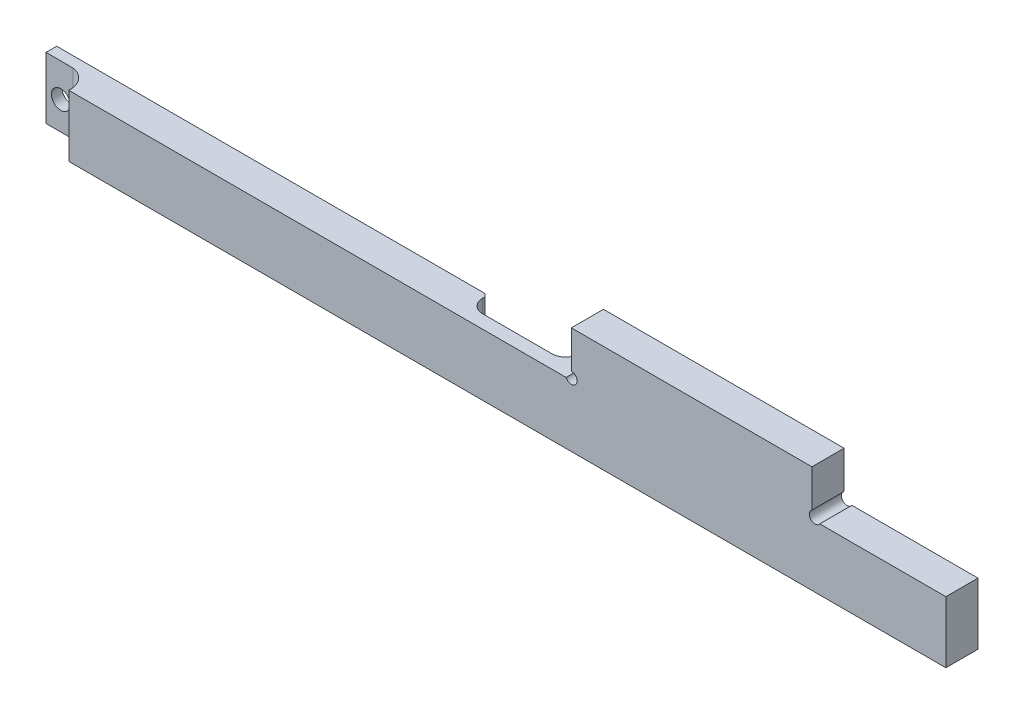
ISO-10303-21;
HEADER;
FILE_DESCRIPTION(('STEP AP214'),'2;1');
FILE_NAME('part.step','',(''),(''),'','','');
FILE_SCHEMA(('AUTOMOTIVE_DESIGN { 1 0 10303 214 1 1 1 1 }'));
ENDSEC;
DATA;
#1=APPLICATION_CONTEXT('core data for automotive mechanical design processes');
#2=APPLICATION_PROTOCOL_DEFINITION('international standard','automotive_design',2000,#1);
#3=PRODUCT_CONTEXT('',#1,'mechanical');
#4=PRODUCT('Part','Part','',(#3));
#5=PRODUCT_RELATED_PRODUCT_CATEGORY('part','',(#4));
#6=PRODUCT_DEFINITION_FORMATION('','',#4);
#7=PRODUCT_DEFINITION_CONTEXT('part definition',#1,'design');
#8=PRODUCT_DEFINITION('design','',#6,#7);
#9=PRODUCT_DEFINITION_SHAPE('','',#8);
#10=(LENGTH_UNIT() NAMED_UNIT(*) SI_UNIT(.MILLI.,.METRE.));
#11=(NAMED_UNIT(*) PLANE_ANGLE_UNIT() SI_UNIT($,.RADIAN.));
#12=(NAMED_UNIT(*) SI_UNIT($,.STERADIAN.) SOLID_ANGLE_UNIT());
#13=UNCERTAINTY_MEASURE_WITH_UNIT(LENGTH_MEASURE(1.E-05),#10,'distance_accuracy_value','');
#14=(GEOMETRIC_REPRESENTATION_CONTEXT(3) GLOBAL_UNCERTAINTY_ASSIGNED_CONTEXT((#13)) GLOBAL_UNIT_ASSIGNED_CONTEXT((#10,
#11,#12)) REPRESENTATION_CONTEXT('',''));
#15=CARTESIAN_POINT('',(0.,0.,0.));
#16=DIRECTION('',(0.,0.,1.));
#17=DIRECTION('',(1.,0.,0.));
#18=AXIS2_PLACEMENT_3D('',#15,#16,#17);
#19=CARTESIAN_POINT('',(167.474370162476,50.814720024073,0.));
#20=DIRECTION('',(0.,0.,1.));
#21=DIRECTION('',(1.,0.,0.));
#22=AXIS2_PLACEMENT_3D('',#19,#20,#21);
#23=PLANE('',#22);
#24=DIRECTION('',(1.,0.,0.));
#25=VECTOR('',#24,1.);
#26=CARTESIAN_POINT('',(-127.662979966611,26.6272522522524,0.));
#27=LINE('',#26,#25);
#28=CARTESIAN_POINT('',(70.337020033389,26.6272522522524,0.));
#29=VERTEX_POINT('',#28);
#30=CARTESIAN_POINT('',(216.337020033389,26.6272522522524,0.));
#31=VERTEX_POINT('',#30);
#32=EDGE_CURVE('E237',#29,#31,#27,.T.);
#33=ORIENTED_EDGE('',*,*,#32,.F.);
#34=DIRECTION('',(0.,1.,0.));
#35=VECTOR('',#34,1.);
#36=CARTESIAN_POINT('',(70.337020033389,50.814720024073,0.));
#37=LINE('',#36,#35);
#38=CARTESIAN_POINT('',(70.3370200333889,49.6272522522523,0.));
#39=VERTEX_POINT('',#38);
#40=EDGE_CURVE('E11',#29,#39,#37,.T.);
#41=ORIENTED_EDGE('',*,*,#40,.T.);
#42=DIRECTION('',(-1.,0.,0.));
#43=VECTOR('',#42,1.);
#44=CARTESIAN_POINT('',(-127.662979966611,49.6272522522508,0.));
#45=LINE('',#44,#43);
#46=CARTESIAN_POINT('',(74.5486599125177,49.6272522522523,0.));
#47=VERTEX_POINT('',#46);
#48=EDGE_CURVE('E217',#47,#39,#45,.T.);
#49=ORIENTED_EDGE('',*,*,#48,.F.);
#50=CARTESIAN_POINT('',(76.5079343794868,50.4875324144114,0.));
#51=DIRECTION('',(0.,0.,-1.));
#52=DIRECTION('',(-1.,0.,0.));
#53=AXIS2_PLACEMENT_3D('',#50,#51,#52);
#54=CIRCLE('',#53,2.13982204734894);
#55=CARTESIAN_POINT('',(76.4870200333889,52.6272522522518,0.));
#56=VERTEX_POINT('',#55);
#57=EDGE_CURVE('E253',#56,#47,#54,.T.);
#58=ORIENTED_EDGE('',*,*,#57,.F.);
#59=DIRECTION('',(0.,-1.,0.));
#60=VECTOR('',#59,1.);
#61=CARTESIAN_POINT('',(76.4870200333889,52.6272522522516,0.));
#62=LINE('',#61,#60);
#63=CARTESIAN_POINT('',(76.487020033389,66.6272522522516,0.));
#64=VERTEX_POINT('',#63);
#65=EDGE_CURVE('E251',#64,#56,#62,.T.);
#66=ORIENTED_EDGE('',*,*,#65,.F.);
#67=DIRECTION('',(-1.,0.,0.));
#68=VECTOR('',#67,1.);
#69=CARTESIAN_POINT('',(166.337020033389,66.6272522522523,0.));
#70=LINE('',#69,#68);
#71=CARTESIAN_POINT('',(166.337020033389,66.6272522522523,0.));
#72=VERTEX_POINT('',#71);
#73=EDGE_CURVE('E249',#72,#64,#70,.T.);
#74=ORIENTED_EDGE('',*,*,#73,.F.);
#75=DIRECTION('',(0.,1.,0.));
#76=VECTOR('',#75,1.);
#77=CARTESIAN_POINT('',(166.337020033389,52.6272522522523,0.));
#78=LINE('',#77,#76);
#79=CARTESIAN_POINT('',(166.337020033389,52.6272522522523,0.));
#80=VERTEX_POINT('',#79);
#81=EDGE_CURVE('E247',#80,#72,#78,.T.);
#82=ORIENTED_EDGE('',*,*,#81,.F.);
#83=CARTESIAN_POINT('',(167.474370162476,50.814720024073,0.));
#84=DIRECTION('',(0.,0.,-1.));
#85=DIRECTION('',(1.,0.,0.));
#86=AXIS2_PLACEMENT_3D('',#83,#84,#85);
#87=CIRCLE('',#86,2.1398220473493);
#88=CARTESIAN_POINT('',(169.254470913897,49.627252252253,0.));
#89=VERTEX_POINT('',#88);
#90=EDGE_CURVE('E245',#89,#80,#87,.T.);
#91=ORIENTED_EDGE('',*,*,#90,.F.);
#92=DIRECTION('',(-1.,0.,0.));
#93=VECTOR('',#92,1.);
#94=CARTESIAN_POINT('',(169.254470913897,49.627252252253,0.));
#95=LINE('',#94,#93);
#96=CARTESIAN_POINT('',(216.337020033389,49.6272522522534,0.));
#97=VERTEX_POINT('',#96);
#98=EDGE_CURVE('E243',#97,#89,#95,.T.);
#99=ORIENTED_EDGE('',*,*,#98,.F.);
#100=DIRECTION('',(0.,1.,0.));
#101=VECTOR('',#100,1.);
#102=CARTESIAN_POINT('',(216.337020033389,49.6272522522534,0.));
#103=LINE('',#102,#101);
#104=EDGE_CURVE('E241',#31,#97,#103,.T.);
#105=ORIENTED_EDGE('',*,*,#104,.F.);
#106=EDGE_LOOP('',(#33,#41,#49,#58,#66,#74,#82,#91,#99,#105));
#107=FACE_BOUND('',#106,.T.);
#108=ADVANCED_FACE('F33',(#107),#23,.F.);
#109=CARTESIAN_POINT('',(-127.662979966611,49.6272522522508,12.));
#110=DIRECTION('',(1.,0.,0.));
#111=DIRECTION('',(0.,1.,0.));
#112=AXIS2_PLACEMENT_3D('',#109,#110,#111);
#113=PLANE('',#112);
#114=DIRECTION('',(0.,0.,-1.));
#115=VECTOR('',#114,1.);
#116=CARTESIAN_POINT('',(-127.662979966611,26.6272522522524,12.));
#117=LINE('',#116,#115);
#118=CARTESIAN_POINT('',(-127.662979966611,26.6272522522522,4.));
#119=VERTEX_POINT('',#118);
#120=CARTESIAN_POINT('',(-127.662979966611,26.6272522522524,0.));
#121=VERTEX_POINT('',#120);
#122=EDGE_CURVE('E283',#119,#121,#117,.T.);
#123=ORIENTED_EDGE('',*,*,#122,.F.);
#124=DIRECTION('',(0.,1.,0.));
#125=VECTOR('',#124,1.);
#126=CARTESIAN_POINT('',(-127.662979966611,26.6272522522522,4.));
#127=LINE('',#126,#125);
#128=CARTESIAN_POINT('',(-127.662979966611,49.6272522522517,4.));
#129=VERTEX_POINT('',#128);
#130=EDGE_CURVE('E175',#119,#129,#127,.T.);
#131=ORIENTED_EDGE('',*,*,#130,.T.);
#132=DIRECTION('',(0.,0.,-1.));
#133=VECTOR('',#132,1.);
#134=CARTESIAN_POINT('',(-127.662979966611,49.6272522522508,12.));
#135=LINE('',#134,#133);
#136=CARTESIAN_POINT('',(-127.662979966611,49.6272522522508,0.));
#137=VERTEX_POINT('',#136);
#138=EDGE_CURVE('E234',#129,#137,#135,.T.);
#139=ORIENTED_EDGE('',*,*,#138,.T.);
#140=DIRECTION('',(0.,-1.,0.));
#141=VECTOR('',#140,1.);
#142=CARTESIAN_POINT('',(-127.662979966611,49.6272522522508,0.));
#143=LINE('',#142,#141);
#144=EDGE_CURVE('E206',#137,#121,#143,.T.);
#145=ORIENTED_EDGE('',*,*,#144,.T.);
#146=EDGE_LOOP('',(#123,#131,#139,#145));
#147=FACE_BOUND('',#146,.T.);
#148=ADVANCED_FACE('F354',(#147),#113,.F.);
#149=CARTESIAN_POINT('',(-127.662979966611,26.6272522522524,12.));
#150=DIRECTION('',(0.,1.,0.));
#151=DIRECTION('',(0.,0.,1.));
#152=AXIS2_PLACEMENT_3D('',#149,#150,#151);
#153=PLANE('',#152);
#154=CARTESIAN_POINT('',(-118.619825704076,26.6272522522522,11.4180621616899));
#155=DIRECTION('',(0.,1.,0.));
#156=DIRECTION('',(1.,0.,0.));
#157=AXIS2_PLACEMENT_3D('',#154,#155,#156);
#158=CIRCLE('',#157,7.479518701093);
#159=CARTESIAN_POINT('',(-111.162979966611,26.6272522522524,12.));
#160=VERTEX_POINT('',#159);
#161=CARTESIAN_POINT('',(-117.662979966611,26.6272522522522,4.));
#162=VERTEX_POINT('',#161);
#163=EDGE_CURVE('E49',#160,#162,#158,.T.);
#164=ORIENTED_EDGE('',*,*,#163,.T.);
#165=DIRECTION('',(-1.,0.,0.));
#166=VECTOR('',#165,1.);
#167=CARTESIAN_POINT('',(-127.662979966611,26.6272522522522,4.));
#168=LINE('',#167,#166);
#169=EDGE_CURVE('E179',#162,#119,#168,.T.);
#170=ORIENTED_EDGE('',*,*,#169,.T.);
#171=ORIENTED_EDGE('',*,*,#122,.T.);
#172=CARTESIAN_POINT('',(32.337020033389,26.6272522522524,0.));
#173=VERTEX_POINT('',#172);
#174=EDGE_CURVE('E238',#121,#173,#27,.T.);
#175=ORIENTED_EDGE('',*,*,#174,.T.);
#176=DIRECTION('',(-0.707106781186557,0.,-0.707106781186538));
#177=VECTOR('',#176,1.);
#178=CARTESIAN_POINT('',(33.337020033389,26.6272522522524,0.999999999999973));
#179=LINE('',#178,#177);
#180=CARTESIAN_POINT('',(33.337020033389,26.6272522522522,0.999999999999973));
#181=VERTEX_POINT('',#180);
#182=EDGE_CURVE('E313',#173,#181,#179,.F.);
#183=ORIENTED_EDGE('',*,*,#182,.T.);
#184=DIRECTION('',(0.,0.,-1.));
#185=VECTOR('',#184,1.);
#186=CARTESIAN_POINT('',(33.337020033389,26.6272522522522,7.));
#187=LINE('',#186,#185);
#188=CARTESIAN_POINT('',(33.337020033389,26.6272522522522,2.));
#189=VERTEX_POINT('',#188);
#190=EDGE_CURVE('E203',#189,#181,#187,.T.);
#191=ORIENTED_EDGE('',*,*,#190,.F.);
#192=CARTESIAN_POINT('',(38.337020033389,26.6272522522524,2.));
#193=DIRECTION('',(0.,1.,0.));
#194=DIRECTION('',(0.,0.,1.));
#195=AXIS2_PLACEMENT_3D('',#192,#193,#194);
#196=CIRCLE('',#195,5.);
#197=CARTESIAN_POINT('',(38.337020033389,26.6272522522522,7.));
#198=VERTEX_POINT('',#197);
#199=EDGE_CURVE('E301',#189,#198,#196,.T.);
#200=ORIENTED_EDGE('',*,*,#199,.T.);
#201=DIRECTION('',(-1.,0.,0.));
#202=VECTOR('',#201,1.);
#203=CARTESIAN_POINT('',(33.337020033389,26.6272522522522,7.));
#204=LINE('',#203,#202);
#205=CARTESIAN_POINT('',(64.337020033389,26.6272522522522,7.));
#206=VERTEX_POINT('',#205);
#207=EDGE_CURVE('E195',#206,#198,#204,.T.);
#208=ORIENTED_EDGE('',*,*,#207,.F.);
#209=CARTESIAN_POINT('',(64.337020033389,26.6272522522524,2.));
#210=DIRECTION('',(0.,1.,0.));
#211=DIRECTION('',(0.,0.,1.));
#212=AXIS2_PLACEMENT_3D('',#209,#210,#211);
#213=CIRCLE('',#212,5.);
#214=CARTESIAN_POINT('',(69.337020033389,26.6272522522522,2.));
#215=VERTEX_POINT('',#214);
#216=EDGE_CURVE('E295',#206,#215,#213,.T.);
#217=ORIENTED_EDGE('',*,*,#216,.T.);
#218=DIRECTION('',(0.,0.,-1.));
#219=VECTOR('',#218,1.);
#220=CARTESIAN_POINT('',(69.337020033389,26.6272522522522,7.));
#221=LINE('',#220,#219);
#222=CARTESIAN_POINT('',(69.337020033389,26.6272522522522,0.999999999999973));
#223=VERTEX_POINT('',#222);
#224=EDGE_CURVE('E204',#215,#223,#221,.T.);
#225=ORIENTED_EDGE('',*,*,#224,.T.);
#226=DIRECTION('',(-0.707106781186557,0.,0.707106781186538));
#227=VECTOR('',#226,1.);
#228=CARTESIAN_POINT('',(69.337020033389,26.6272522522524,0.999999999999973));
#229=LINE('',#228,#227);
#230=EDGE_CURVE('E57',#223,#29,#229,.F.);
#231=ORIENTED_EDGE('',*,*,#230,.T.);
#232=ORIENTED_EDGE('',*,*,#32,.T.);
#233=DIRECTION('',(0.,0.,-1.));
#234=VECTOR('',#233,1.);
#235=CARTESIAN_POINT('',(216.337020033389,26.6272522522524,12.));
#236=LINE('',#235,#234);
#237=CARTESIAN_POINT('',(216.337020033389,26.6272522522524,12.));
#238=VERTEX_POINT('',#237);
#239=EDGE_CURVE('E280',#238,#31,#236,.T.);
#240=ORIENTED_EDGE('',*,*,#239,.F.);
#241=DIRECTION('',(1.,0.,0.));
#242=VECTOR('',#241,1.);
#243=CARTESIAN_POINT('',(-127.662979966611,26.6272522522524,12.));
#244=LINE('',#243,#242);
#245=EDGE_CURVE('E187',#160,#238,#244,.T.);
#246=ORIENTED_EDGE('',*,*,#245,.F.);
#247=EDGE_LOOP('',(#164,#170,#171,#175,#183,#191,#200,#208,#217,#225,#231,#232,#240,#246));
#248=FACE_BOUND('',#247,.T.);
#249=ADVANCED_FACE('F185',(#248),#153,.F.);
#250=CARTESIAN_POINT('',(216.337020033389,49.6272522522534,12.));
#251=DIRECTION('',(-1.,0.,0.));
#252=DIRECTION('',(0.,0.,1.));
#253=AXIS2_PLACEMENT_3D('',#250,#251,#252);
#254=PLANE('',#253);
#255=ORIENTED_EDGE('',*,*,#104,.T.);
#256=DIRECTION('',(0.,0.,-1.));
#257=VECTOR('',#256,1.);
#258=CARTESIAN_POINT('',(216.337020033389,49.6272522522534,12.));
#259=LINE('',#258,#257);
#260=CARTESIAN_POINT('',(216.337020033389,49.6272522522534,12.));
#261=VERTEX_POINT('',#260);
#262=EDGE_CURVE('E277',#261,#97,#259,.T.);
#263=ORIENTED_EDGE('',*,*,#262,.F.);
#264=DIRECTION('',(0.,1.,0.));
#265=VECTOR('',#264,1.);
#266=CARTESIAN_POINT('',(216.337020033389,49.6272522522534,12.));
#267=LINE('',#266,#265);
#268=EDGE_CURVE('E216',#238,#261,#267,.T.);
#269=ORIENTED_EDGE('',*,*,#268,.F.);
#270=ORIENTED_EDGE('',*,*,#239,.T.);
#271=EDGE_LOOP('',(#255,#263,#269,#270));
#272=FACE_BOUND('',#271,.T.);
#273=ADVANCED_FACE('F345',(#272),#254,.F.);
#274=CARTESIAN_POINT('',(169.254470913897,49.627252252253,12.));
#275=DIRECTION('',(0.,-1.,0.));
#276=DIRECTION('',(1.,0.,0.));
#277=AXIS2_PLACEMENT_3D('',#274,#275,#276);
#278=PLANE('',#277);
#279=ORIENTED_EDGE('',*,*,#98,.T.);
#280=DIRECTION('',(0.,0.,-1.));
#281=VECTOR('',#280,1.);
#282=CARTESIAN_POINT('',(169.254470913897,49.627252252253,12.));
#283=LINE('',#282,#281);
#284=CARTESIAN_POINT('',(169.254470913897,49.627252252253,12.));
#285=VERTEX_POINT('',#284);
#286=EDGE_CURVE('E274',#285,#89,#283,.T.);
#287=ORIENTED_EDGE('',*,*,#286,.F.);
#288=DIRECTION('',(-1.,0.,0.));
#289=VECTOR('',#288,1.);
#290=CARTESIAN_POINT('',(169.254470913897,49.627252252253,12.));
#291=LINE('',#290,#289);
#292=EDGE_CURVE('E219',#261,#285,#291,.T.);
#293=ORIENTED_EDGE('',*,*,#292,.F.);
#294=ORIENTED_EDGE('',*,*,#262,.T.);
#295=EDGE_LOOP('',(#279,#287,#293,#294));
#296=FACE_BOUND('',#295,.T.);
#297=ADVANCED_FACE('F509',(#296),#278,.F.);
#298=CARTESIAN_POINT('',(167.474370162476,50.814720024073,12.));
#299=DIRECTION('',(0.,0.,-1.));
#300=DIRECTION('',(-1.,0.,0.));
#301=AXIS2_PLACEMENT_3D('',#298,#299,#300);
#302=CYLINDRICAL_SURFACE('',#301,2.1398220473493);
#303=ORIENTED_EDGE('',*,*,#90,.T.);
#304=DIRECTION('',(0.,0.,-1.));
#305=VECTOR('',#304,1.);
#306=CARTESIAN_POINT('',(166.337020033389,52.6272522522523,12.));
#307=LINE('',#306,#305);
#308=CARTESIAN_POINT('',(166.337020033389,52.6272522522523,12.));
#309=VERTEX_POINT('',#308);
#310=EDGE_CURVE('E271',#309,#80,#307,.T.);
#311=ORIENTED_EDGE('',*,*,#310,.F.);
#312=CARTESIAN_POINT('',(167.474370162476,50.814720024073,12.));
#313=DIRECTION('',(0.,0.,-1.));
#314=DIRECTION('',(1.,0.,0.));
#315=AXIS2_PLACEMENT_3D('',#312,#313,#314);
#316=CIRCLE('',#315,2.1398220473493);
#317=EDGE_CURVE('E221',#285,#309,#316,.T.);
#318=ORIENTED_EDGE('',*,*,#317,.F.);
#319=ORIENTED_EDGE('',*,*,#286,.T.);
#320=EDGE_LOOP('',(#303,#311,#318,#319));
#321=FACE_BOUND('',#320,.T.);
#322=ADVANCED_FACE('F500',(#321),#302,.F.);
#323=CARTESIAN_POINT('',(166.337020033389,52.6272522522523,12.));
#324=DIRECTION('',(-1.,0.,0.));
#325=DIRECTION('',(0.,0.,1.));
#326=AXIS2_PLACEMENT_3D('',#323,#324,#325);
#327=PLANE('',#326);
#328=ORIENTED_EDGE('',*,*,#81,.T.);
#329=DIRECTION('',(0.,0.,-1.));
#330=VECTOR('',#329,1.);
#331=CARTESIAN_POINT('',(166.337020033389,66.6272522522523,12.));
#332=LINE('',#331,#330);
#333=CARTESIAN_POINT('',(166.337020033389,66.6272522522523,12.));
#334=VERTEX_POINT('',#333);
#335=EDGE_CURVE('E268',#334,#72,#332,.T.);
#336=ORIENTED_EDGE('',*,*,#335,.F.);
#337=DIRECTION('',(0.,1.,0.));
#338=VECTOR('',#337,1.);
#339=CARTESIAN_POINT('',(166.337020033389,52.6272522522523,12.));
#340=LINE('',#339,#338);
#341=EDGE_CURVE('E223',#309,#334,#340,.T.);
#342=ORIENTED_EDGE('',*,*,#341,.F.);
#343=ORIENTED_EDGE('',*,*,#310,.T.);
#344=EDGE_LOOP('',(#328,#336,#342,#343));
#345=FACE_BOUND('',#344,.T.);
#346=ADVANCED_FACE('F491',(#345),#327,.F.);
#347=CARTESIAN_POINT('',(166.337020033389,66.6272522522523,12.));
#348=DIRECTION('',(0.,-1.,0.));
#349=DIRECTION('',(1.,0.,0.));
#350=AXIS2_PLACEMENT_3D('',#347,#348,#349);
#351=PLANE('',#350);
#352=ORIENTED_EDGE('',*,*,#73,.T.);
#353=DIRECTION('',(0.,0.,-1.));
#354=VECTOR('',#353,1.);
#355=CARTESIAN_POINT('',(76.487020033389,66.6272522522516,12.));
#356=LINE('',#355,#354);
#357=CARTESIAN_POINT('',(76.487020033389,66.6272522522516,12.));
#358=VERTEX_POINT('',#357);
#359=EDGE_CURVE('E265',#358,#64,#356,.T.);
#360=ORIENTED_EDGE('',*,*,#359,.F.);
#361=DIRECTION('',(-1.,0.,0.));
#362=VECTOR('',#361,1.);
#363=CARTESIAN_POINT('',(166.337020033389,66.6272522522523,12.));
#364=LINE('',#363,#362);
#365=EDGE_CURVE('E225',#334,#358,#364,.T.);
#366=ORIENTED_EDGE('',*,*,#365,.F.);
#367=ORIENTED_EDGE('',*,*,#335,.T.);
#368=EDGE_LOOP('',(#352,#360,#366,#367));
#369=FACE_BOUND('',#368,.T.);
#370=ADVANCED_FACE('F482',(#369),#351,.F.);
#371=CARTESIAN_POINT('',(76.4870200333889,52.6272522522516,12.));
#372=DIRECTION('',(1.,0.,0.));
#373=DIRECTION('',(0.,1.,0.));
#374=AXIS2_PLACEMENT_3D('',#371,#372,#373);
#375=PLANE('',#374);
#376=ORIENTED_EDGE('',*,*,#65,.T.);
#377=DIRECTION('',(0.,0.,-1.));
#378=VECTOR('',#377,1.);
#379=CARTESIAN_POINT('',(76.4870200333889,52.6272522522518,12.));
#380=LINE('',#379,#378);
#381=CARTESIAN_POINT('',(76.4870200333889,52.6272522522518,12.));
#382=VERTEX_POINT('',#381);
#383=EDGE_CURVE('E262',#382,#56,#380,.T.);
#384=ORIENTED_EDGE('',*,*,#383,.F.);
#385=DIRECTION('',(0.,-1.,0.));
#386=VECTOR('',#385,1.);
#387=CARTESIAN_POINT('',(76.4870200333889,52.6272522522516,12.));
#388=LINE('',#387,#386);
#389=EDGE_CURVE('E227',#358,#382,#388,.T.);
#390=ORIENTED_EDGE('',*,*,#389,.F.);
#391=ORIENTED_EDGE('',*,*,#359,.T.);
#392=EDGE_LOOP('',(#376,#384,#390,#391));
#393=FACE_BOUND('',#392,.T.);
#394=ADVANCED_FACE('F473',(#393),#375,.F.);
#395=CARTESIAN_POINT('',(76.5079343794868,50.4875324144114,12.));
#396=DIRECTION('',(0.,0.,-1.));
#397=DIRECTION('',(-1.,0.,0.));
#398=AXIS2_PLACEMENT_3D('',#395,#396,#397);
#399=CYLINDRICAL_SURFACE('',#398,2.13982204734894);
#400=ORIENTED_EDGE('',*,*,#57,.T.);
#401=DIRECTION('',(0.,0.,-1.));
#402=VECTOR('',#401,1.);
#403=CARTESIAN_POINT('',(74.5486599125177,49.6272522522523,12.));
#404=LINE('',#403,#402);
#405=CARTESIAN_POINT('',(74.5486599125177,49.6272522522523,12.));
#406=VERTEX_POINT('',#405);
#407=EDGE_CURVE('E259',#406,#47,#404,.T.);
#408=ORIENTED_EDGE('',*,*,#407,.F.);
#409=CARTESIAN_POINT('',(76.5079343794868,50.4875324144114,12.));
#410=DIRECTION('',(0.,0.,-1.));
#411=DIRECTION('',(-1.,0.,0.));
#412=AXIS2_PLACEMENT_3D('',#409,#410,#411);
#413=CIRCLE('',#412,2.13982204734894);
#414=EDGE_CURVE('E229',#382,#406,#413,.T.);
#415=ORIENTED_EDGE('',*,*,#414,.F.);
#416=ORIENTED_EDGE('',*,*,#383,.T.);
#417=EDGE_LOOP('',(#400,#408,#415,#416));
#418=FACE_BOUND('',#417,.T.);
#419=ADVANCED_FACE('F466',(#418),#399,.F.);
#420=CARTESIAN_POINT('',(-127.662979966611,49.6272522522508,12.));
#421=DIRECTION('',(0.,-1.,0.));
#422=DIRECTION('',(1.,0.,0.));
#423=AXIS2_PLACEMENT_3D('',#420,#421,#422);
#424=PLANE('',#423);
#425=ORIENTED_EDGE('',*,*,#138,.F.);
#426=DIRECTION('',(-1.,0.,0.));
#427=VECTOR('',#426,1.);
#428=CARTESIAN_POINT('',(-127.662979966611,49.6272522522517,4.));
#429=LINE('',#428,#427);
#430=CARTESIAN_POINT('',(-117.662979966611,49.6272522522517,4.));
#431=VERTEX_POINT('',#430);
#432=EDGE_CURVE('E188',#431,#129,#429,.T.);
#433=ORIENTED_EDGE('',*,*,#432,.F.);
#434=CARTESIAN_POINT('',(-118.619825704076,49.6272522522517,11.4180621616899));
#435=DIRECTION('',(0.,1.,0.));
#436=DIRECTION('',(1.,0.,0.));
#437=AXIS2_PLACEMENT_3D('',#434,#435,#436);
#438=CIRCLE('',#437,7.479518701093);
#439=CARTESIAN_POINT('',(-111.162979966611,49.6272522522517,12.));
#440=VERTEX_POINT('',#439);
#441=EDGE_CURVE('E172',#440,#431,#438,.T.);
#442=ORIENTED_EDGE('',*,*,#441,.F.);
#443=DIRECTION('',(-1.,0.,0.));
#444=VECTOR('',#443,1.);
#445=CARTESIAN_POINT('',(-127.662979966611,49.6272522522508,12.));
#446=LINE('',#445,#444);
#447=EDGE_CURVE('E231',#406,#440,#446,.T.);
#448=ORIENTED_EDGE('',*,*,#447,.F.);
#449=ORIENTED_EDGE('',*,*,#407,.T.);
#450=ORIENTED_EDGE('',*,*,#48,.T.);
#451=DIRECTION('',(0.707106781186557,0.,-0.707106781186538));
#452=VECTOR('',#451,1.);
#453=CARTESIAN_POINT('',(69.3370200333889,49.6272522522523,1.00000000000006));
#454=LINE('',#453,#452);
#455=CARTESIAN_POINT('',(69.337020033389,49.6272522522523,0.999999999999973));
#456=VERTEX_POINT('',#455);
#457=EDGE_CURVE('E306',#39,#456,#454,.F.);
#458=ORIENTED_EDGE('',*,*,#457,.T.);
#459=DIRECTION('',(0.,0.,-1.));
#460=VECTOR('',#459,1.);
#461=CARTESIAN_POINT('',(69.337020033389,49.6272522522523,7.));
#462=LINE('',#461,#460);
#463=CARTESIAN_POINT('',(69.337020033389,49.6272522522523,2.));
#464=VERTEX_POINT('',#463);
#465=EDGE_CURVE('E207',#464,#456,#462,.T.);
#466=ORIENTED_EDGE('',*,*,#465,.F.);
#467=CARTESIAN_POINT('',(64.337020033389,49.6272522522522,2.));
#468=DIRECTION('',(0.,-1.,0.));
#469=DIRECTION('',(1.,0.,0.));
#470=AXIS2_PLACEMENT_3D('',#467,#468,#469);
#471=CIRCLE('',#470,5.);
#472=CARTESIAN_POINT('',(64.337020033389,49.6272522522523,7.));
#473=VERTEX_POINT('',#472);
#474=EDGE_CURVE('E297',#464,#473,#471,.T.);
#475=ORIENTED_EDGE('',*,*,#474,.T.);
#476=DIRECTION('',(1.,0.,0.));
#477=VECTOR('',#476,1.);
#478=CARTESIAN_POINT('',(33.337020033389,49.6272522522523,7.));
#479=LINE('',#478,#477);
#480=CARTESIAN_POINT('',(38.337020033389,49.6272522522523,7.));
#481=VERTEX_POINT('',#480);
#482=EDGE_CURVE('E200',#481,#473,#479,.T.);
#483=ORIENTED_EDGE('',*,*,#482,.F.);
#484=CARTESIAN_POINT('',(38.337020033389,49.627252252252,2.));
#485=DIRECTION('',(0.,-1.,0.));
#486=DIRECTION('',(1.,0.,0.));
#487=AXIS2_PLACEMENT_3D('',#484,#485,#486);
#488=CIRCLE('',#487,5.);
#489=CARTESIAN_POINT('',(33.337020033389,49.6272522522523,2.));
#490=VERTEX_POINT('',#489);
#491=EDGE_CURVE('E299',#481,#490,#488,.T.);
#492=ORIENTED_EDGE('',*,*,#491,.T.);
#493=DIRECTION('',(0.,0.,-1.));
#494=VECTOR('',#493,1.);
#495=CARTESIAN_POINT('',(33.337020033389,49.6272522522523,7.));
#496=LINE('',#495,#494);
#497=CARTESIAN_POINT('',(33.337020033389,49.6272522522523,0.999999999999973));
#498=VERTEX_POINT('',#497);
#499=EDGE_CURVE('E210',#490,#498,#496,.T.);
#500=ORIENTED_EDGE('',*,*,#499,.T.);
#501=DIRECTION('',(0.707106781186557,0.,0.707106781186538));
#502=VECTOR('',#501,1.);
#503=CARTESIAN_POINT('',(33.3370200333889,49.627252252252,0.999999999999886));
#504=LINE('',#503,#502);
#505=CARTESIAN_POINT('',(32.3370200333889,49.627252252252,0.));
#506=VERTEX_POINT('',#505);
#507=EDGE_CURVE('E308',#498,#506,#504,.F.);
#508=ORIENTED_EDGE('',*,*,#507,.T.);
#509=EDGE_CURVE('E255',#506,#137,#45,.T.);
#510=ORIENTED_EDGE('',*,*,#509,.T.);
#511=EDGE_LOOP('',(#425,#433,#442,#448,#449,#450,#458,#466,#475,#483,#492,#500,#508,#510));
#512=FACE_BOUND('',#511,.T.);
#513=ADVANCED_FACE('F335',(#512),#424,.F.);
#514=CARTESIAN_POINT('',(167.474370162476,50.814720024073,12.));
#515=DIRECTION('',(0.,0.,1.));
#516=DIRECTION('',(1.,0.,0.));
#517=AXIS2_PLACEMENT_3D('',#514,#515,#516);
#518=PLANE('',#517);
#519=DIRECTION('',(0.,1.,0.));
#520=VECTOR('',#519,1.);
#521=CARTESIAN_POINT('',(-111.162979966611,26.6272522522522,12.));
#522=LINE('',#521,#520);
#523=EDGE_CURVE('E176',#160,#440,#522,.T.);
#524=ORIENTED_EDGE('',*,*,#523,.F.);
#525=ORIENTED_EDGE('',*,*,#245,.T.);
#526=ORIENTED_EDGE('',*,*,#268,.T.);
#527=ORIENTED_EDGE('',*,*,#292,.T.);
#528=ORIENTED_EDGE('',*,*,#317,.T.);
#529=ORIENTED_EDGE('',*,*,#341,.T.);
#530=ORIENTED_EDGE('',*,*,#365,.T.);
#531=ORIENTED_EDGE('',*,*,#389,.T.);
#532=ORIENTED_EDGE('',*,*,#414,.T.);
#533=ORIENTED_EDGE('',*,*,#447,.T.);
#534=EDGE_LOOP('',(#524,#525,#526,#527,#528,#529,#530,#531,#532,#533));
#535=FACE_BOUND('',#534,.T.);
#536=ADVANCED_FACE('F349',(#535),#518,.T.);
#537=CARTESIAN_POINT('',(-122.162979966611,37.1272522522522,0.));
#538=DIRECTION('',(0.,0.,1.));
#539=DIRECTION('',(1.,0.,0.));
#540=AXIS2_PLACEMENT_3D('',#537,#538,#539);
#541=CIRCLE('',#540,3.50000000000001);
#542=CARTESIAN_POINT('',(-118.662979966611,37.1272522522522,0.));
#543=VERTEX_POINT('',#542);
#544=EDGE_CURVE('E192',#543,#543,#541,.T.);
#545=ORIENTED_EDGE('',*,*,#544,.T.);
#546=EDGE_LOOP('',(#545));
#547=FACE_BOUND('',#546,.T.);
#548=ORIENTED_EDGE('',*,*,#509,.F.);
#549=DIRECTION('',(0.,-1.,0.));
#550=VECTOR('',#549,1.);
#551=CARTESIAN_POINT('',(32.337020033389,50.8147200240731,0.));
#552=LINE('',#551,#550);
#553=EDGE_CURVE('E310',#506,#173,#552,.T.);
#554=ORIENTED_EDGE('',*,*,#553,.T.);
#555=ORIENTED_EDGE('',*,*,#174,.F.);
#556=ORIENTED_EDGE('',*,*,#144,.F.);
#557=EDGE_LOOP('',(#548,#554,#555,#556));
#558=FACE_BOUND('',#557,.T.);
#559=ADVANCED_FACE('F360',(#547,#558),#23,.F.);
#560=CARTESIAN_POINT('',(69.337020033389,26.6272522522522,7.));
#561=DIRECTION('',(1.,0.,0.));
#562=DIRECTION('',(0.,0.,-1.));
#563=AXIS2_PLACEMENT_3D('',#560,#561,#562);
#564=PLANE('',#563);
#565=ORIENTED_EDGE('',*,*,#465,.T.);
#566=DIRECTION('',(0.,-1.,0.));
#567=VECTOR('',#566,1.);
#568=CARTESIAN_POINT('',(69.337020033389,26.6272522522522,0.999999999999973));
#569=LINE('',#568,#567);
#570=EDGE_CURVE('E42',#456,#223,#569,.T.);
#571=ORIENTED_EDGE('',*,*,#570,.T.);
#572=ORIENTED_EDGE('',*,*,#224,.F.);
#573=DIRECTION('',(0.,-1.,0.));
#574=VECTOR('',#573,1.);
#575=CARTESIAN_POINT('',(69.337020033389,49.6272522522523,2.));
#576=LINE('',#575,#574);
#577=EDGE_CURVE('E291',#215,#464,#576,.F.);
#578=ORIENTED_EDGE('',*,*,#577,.T.);
#579=EDGE_LOOP('',(#565,#571,#572,#578));
#580=FACE_BOUND('',#579,.T.);
#581=ADVANCED_FACE('F319',(#580),#564,.F.);
#582=CARTESIAN_POINT('',(33.337020033389,26.6272522522522,7.));
#583=DIRECTION('',(-1.,0.,0.));
#584=DIRECTION('',(0.,-1.,0.));
#585=AXIS2_PLACEMENT_3D('',#582,#583,#584);
#586=PLANE('',#585);
#587=ORIENTED_EDGE('',*,*,#190,.T.);
#588=DIRECTION('',(0.,1.,0.));
#589=VECTOR('',#588,1.);
#590=CARTESIAN_POINT('',(33.337020033389,26.6272522522522,0.999999999999973));
#591=LINE('',#590,#589);
#592=EDGE_CURVE('E303',#181,#498,#591,.T.);
#593=ORIENTED_EDGE('',*,*,#592,.T.);
#594=ORIENTED_EDGE('',*,*,#499,.F.);
#595=DIRECTION('',(0.,1.,0.));
#596=VECTOR('',#595,1.);
#597=CARTESIAN_POINT('',(33.337020033389,26.6272522522522,2.));
#598=LINE('',#597,#596);
#599=EDGE_CURVE('E293',#490,#189,#598,.F.);
#600=ORIENTED_EDGE('',*,*,#599,.T.);
#601=EDGE_LOOP('',(#587,#593,#594,#600));
#602=FACE_BOUND('',#601,.T.);
#603=ADVANCED_FACE('F368',(#602),#586,.F.);
#604=CARTESIAN_POINT('',(0.,0.,7.));
#605=DIRECTION('',(0.,0.,1.));
#606=DIRECTION('',(1.,0.,0.));
#607=AXIS2_PLACEMENT_3D('',#604,#605,#606);
#608=PLANE('',#607);
#609=ORIENTED_EDGE('',*,*,#482,.T.);
#610=DIRECTION('',(0.,-1.,0.));
#611=VECTOR('',#610,1.);
#612=CARTESIAN_POINT('',(64.337020033389,26.6272522522522,7.));
#613=LINE('',#612,#611);
#614=EDGE_CURVE('E288',#473,#206,#613,.T.);
#615=ORIENTED_EDGE('',*,*,#614,.T.);
#616=ORIENTED_EDGE('',*,*,#207,.T.);
#617=DIRECTION('',(0.,1.,0.));
#618=VECTOR('',#617,1.);
#619=CARTESIAN_POINT('',(38.337020033389,49.6272522522523,7.));
#620=LINE('',#619,#618);
#621=EDGE_CURVE('E285',#198,#481,#620,.T.);
#622=ORIENTED_EDGE('',*,*,#621,.T.);
#623=EDGE_LOOP('',(#609,#615,#616,#622));
#624=FACE_BOUND('',#623,.T.);
#625=ADVANCED_FACE('F330',(#624),#608,.F.);
#626=CARTESIAN_POINT('',(64.337020033389,0.,2.));
#627=DIRECTION('',(0.,1.,0.));
#628=DIRECTION('',(0.,0.,1.));
#629=AXIS2_PLACEMENT_3D('',#626,#627,#628);
#630=CYLINDRICAL_SURFACE('',#629,5.);
#631=ORIENTED_EDGE('',*,*,#474,.F.);
#632=ORIENTED_EDGE('',*,*,#577,.F.);
#633=ORIENTED_EDGE('',*,*,#216,.F.);
#634=ORIENTED_EDGE('',*,*,#614,.F.);
#635=EDGE_LOOP('',(#631,#632,#633,#634));
#636=FACE_BOUND('',#635,.T.);
#637=ADVANCED_FACE('F328',(#636),#630,.F.);
#638=CARTESIAN_POINT('',(38.337020033389,0.,2.));
#639=DIRECTION('',(0.,-1.,0.));
#640=DIRECTION('',(1.,0.,0.));
#641=AXIS2_PLACEMENT_3D('',#638,#639,#640);
#642=CYLINDRICAL_SURFACE('',#641,5.);
#643=ORIENTED_EDGE('',*,*,#199,.F.);
#644=ORIENTED_EDGE('',*,*,#599,.F.);
#645=ORIENTED_EDGE('',*,*,#491,.F.);
#646=ORIENTED_EDGE('',*,*,#621,.F.);
#647=EDGE_LOOP('',(#643,#644,#645,#646));
#648=FACE_BOUND('',#647,.T.);
#649=ADVANCED_FACE('F371',(#648),#642,.F.);
#650=CARTESIAN_POINT('',(33.337020033389,26.6272522522522,0.999999999999973));
#651=DIRECTION('',(-0.707106781186538,0.,0.707106781186558));
#652=DIRECTION('',(0.,1.,0.));
#653=AXIS2_PLACEMENT_3D('',#650,#651,#652);
#654=PLANE('',#653);
#655=ORIENTED_EDGE('',*,*,#182,.F.);
#656=ORIENTED_EDGE('',*,*,#553,.F.);
#657=ORIENTED_EDGE('',*,*,#507,.F.);
#658=ORIENTED_EDGE('',*,*,#592,.F.);
#659=EDGE_LOOP('',(#655,#656,#657,#658));
#660=FACE_BOUND('',#659,.T.);
#661=ADVANCED_FACE('F363',(#660),#654,.F.);
#662=CARTESIAN_POINT('',(69.337020033389,26.6272522522522,0.999999999999973));
#663=DIRECTION('',(0.707106781186538,0.,0.707106781186557));
#664=DIRECTION('',(0.,-1.,0.));
#665=AXIS2_PLACEMENT_3D('',#662,#663,#664);
#666=PLANE('',#665);
#667=ORIENTED_EDGE('',*,*,#457,.F.);
#668=ORIENTED_EDGE('',*,*,#40,.F.);
#669=ORIENTED_EDGE('',*,*,#230,.F.);
#670=ORIENTED_EDGE('',*,*,#570,.F.);
#671=EDGE_LOOP('',(#667,#668,#669,#670));
#672=FACE_BOUND('',#671,.T.);
#673=ADVANCED_FACE('F35',(#672),#666,.F.);
#674=CARTESIAN_POINT('',(-127.662979966611,26.6272522522522,4.));
#675=DIRECTION('',(0.,0.,-1.));
#676=DIRECTION('',(-1.,0.,0.));
#677=AXIS2_PLACEMENT_3D('',#674,#675,#676);
#678=PLANE('',#677);
#679=CARTESIAN_POINT('',(-122.162979966611,37.1272522522522,4.));
#680=DIRECTION('',(0.,0.,-1.));
#681=DIRECTION('',(-1.,0.,0.));
#682=AXIS2_PLACEMENT_3D('',#679,#680,#681);
#683=CIRCLE('',#682,3.50000000000001);
#684=CARTESIAN_POINT('',(-125.662979966611,37.1272522522522,4.));
#685=VERTEX_POINT('',#684);
#686=EDGE_CURVE('E37',#685,#685,#683,.T.);
#687=ORIENTED_EDGE('',*,*,#686,.T.);
#688=EDGE_LOOP('',(#687));
#689=FACE_BOUND('',#688,.T.);
#690=ORIENTED_EDGE('',*,*,#432,.T.);
#691=ORIENTED_EDGE('',*,*,#130,.F.);
#692=ORIENTED_EDGE('',*,*,#169,.F.);
#693=DIRECTION('',(0.,1.,0.));
#694=VECTOR('',#693,1.);
#695=CARTESIAN_POINT('',(-117.662979966611,26.6272522522522,4.));
#696=LINE('',#695,#694);
#697=EDGE_CURVE('E168',#162,#431,#696,.T.);
#698=ORIENTED_EDGE('',*,*,#697,.T.);
#699=EDGE_LOOP('',(#690,#691,#692,#698));
#700=FACE_BOUND('',#699,.T.);
#701=ADVANCED_FACE('F180',(#689,#700),#678,.F.);
#702=CARTESIAN_POINT('',(-118.619825704076,26.6272522522522,11.4180621616899));
#703=DIRECTION('',(0.,1.,0.));
#704=DIRECTION('',(-1.,0.,0.));
#705=AXIS2_PLACEMENT_3D('',#702,#703,#704);
#706=CYLINDRICAL_SURFACE('',#705,7.479518701093);
#707=ORIENTED_EDGE('',*,*,#441,.T.);
#708=ORIENTED_EDGE('',*,*,#697,.F.);
#709=ORIENTED_EDGE('',*,*,#163,.F.);
#710=ORIENTED_EDGE('',*,*,#523,.T.);
#711=EDGE_LOOP('',(#707,#708,#709,#710));
#712=FACE_BOUND('',#711,.T.);
#713=ADVANCED_FACE('F170',(#712),#706,.F.);
#714=CARTESIAN_POINT('',(-122.162979966611,37.1272522522522,-6.));
#715=DIRECTION('',(0.,0.,1.));
#716=DIRECTION('',(1.,0.,0.));
#717=AXIS2_PLACEMENT_3D('',#714,#715,#716);
#718=CYLINDRICAL_SURFACE('',#717,3.50000000000001);
#719=ORIENTED_EDGE('',*,*,#686,.F.);
#720=EDGE_LOOP('',(#719));
#721=FACE_BOUND('',#720,.T.);
#722=ORIENTED_EDGE('',*,*,#544,.F.);
#723=EDGE_LOOP('',(#722));
#724=FACE_BOUND('',#723,.T.);
#725=ADVANCED_FACE('F401',(#721,#724),#718,.F.);
#726=CLOSED_SHELL('',(#108,#148,#249,#273,#297,#322,#346,#370,#394,#419,#513,#536,#559,#581,
#603,#625,#637,#649,#661,#673,#701,#713,#725));
#727=MANIFOLD_SOLID_BREP('B2',#726);
#728=ADVANCED_BREP_SHAPE_REPRESENTATION('',(#18,#727),#14);
#729=SHAPE_DEFINITION_REPRESENTATION(#9,#728);
ENDSEC;
END-ISO-10303-21;
